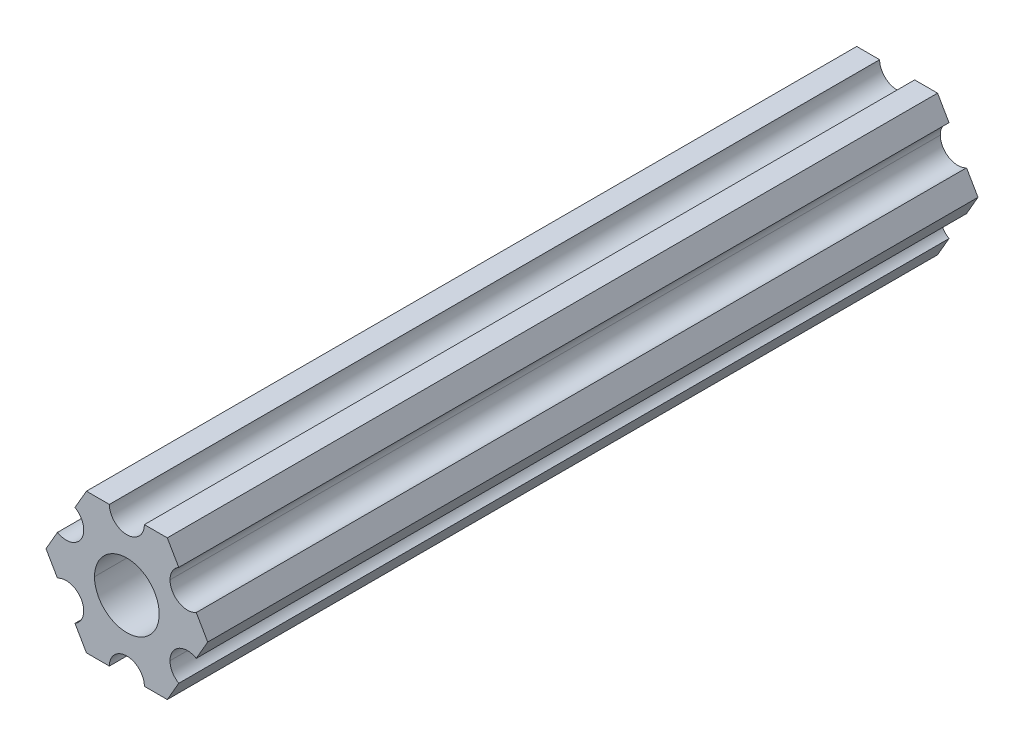
ISO-10303-21;
HEADER;
FILE_DESCRIPTION(('STEP AP214'),'2;1');
FILE_NAME('part.step','',(''),(''),'','','');
FILE_SCHEMA(('AUTOMOTIVE_DESIGN { 1 0 10303 214 1 1 1 1 }'));
ENDSEC;
DATA;
#1=APPLICATION_CONTEXT('core data for automotive mechanical design processes');
#2=APPLICATION_PROTOCOL_DEFINITION('international standard','automotive_design',2000,#1);
#3=PRODUCT_CONTEXT('',#1,'mechanical');
#4=PRODUCT('Part','Part','',(#3));
#5=PRODUCT_RELATED_PRODUCT_CATEGORY('part','',(#4));
#6=PRODUCT_DEFINITION_FORMATION('','',#4);
#7=PRODUCT_DEFINITION_CONTEXT('part definition',#1,'design');
#8=PRODUCT_DEFINITION('design','',#6,#7);
#9=PRODUCT_DEFINITION_SHAPE('','',#8);
#10=(LENGTH_UNIT() NAMED_UNIT(*) SI_UNIT(.MILLI.,.METRE.));
#11=(NAMED_UNIT(*) PLANE_ANGLE_UNIT() SI_UNIT($,.RADIAN.));
#12=(NAMED_UNIT(*) SI_UNIT($,.STERADIAN.) SOLID_ANGLE_UNIT());
#13=UNCERTAINTY_MEASURE_WITH_UNIT(LENGTH_MEASURE(1.E-05),#10,'distance_accuracy_value','');
#14=(GEOMETRIC_REPRESENTATION_CONTEXT(3) GLOBAL_UNCERTAINTY_ASSIGNED_CONTEXT((#13)) GLOBAL_UNIT_ASSIGNED_CONTEXT((#10,
#11,#12)) REPRESENTATION_CONTEXT('',''));
#15=CARTESIAN_POINT('',(0.,0.,0.));
#16=DIRECTION('',(0.,0.,1.));
#17=DIRECTION('',(1.,0.,0.));
#18=AXIS2_PLACEMENT_3D('',#15,#16,#17);
#19=CARTESIAN_POINT('',(0.,0.,69.85));
#20=DIRECTION('',(0.,0.,-1.));
#21=DIRECTION('',(-1.,0.,0.));
#22=AXIS2_PLACEMENT_3D('',#19,#20,#21);
#23=CYLINDRICAL_SURFACE('',#22,2.9337);
#24=DIRECTION('',(0.,0.,-1.));
#25=VECTOR('',#24,1.);
#26=CARTESIAN_POINT('',(2.9337,0.,69.85));
#27=LINE('',#26,#25);
#28=CARTESIAN_POINT('',(2.9337,0.,69.85));
#29=VERTEX_POINT('',#28);
#30=CARTESIAN_POINT('',(2.9337,0.,0.));
#31=VERTEX_POINT('',#30);
#32=EDGE_CURVE('E288',#29,#31,#27,.T.);
#33=ORIENTED_EDGE('',*,*,#32,.F.);
#34=CARTESIAN_POINT('',(0.,0.,69.85));
#35=DIRECTION('',(0.,0.,1.));
#36=DIRECTION('',(1.,0.,0.));
#37=AXIS2_PLACEMENT_3D('',#34,#35,#36);
#38=CIRCLE('',#37,2.9337);
#39=CARTESIAN_POINT('',(-2.9337,0.,69.85));
#40=VERTEX_POINT('',#39);
#41=EDGE_CURVE('E366',#29,#40,#38,.T.);
#42=ORIENTED_EDGE('',*,*,#41,.T.);
#43=DIRECTION('',(0.,0.,-1.));
#44=VECTOR('',#43,1.);
#45=CARTESIAN_POINT('',(-2.9337,0.,69.85));
#46=LINE('',#45,#44);
#47=CARTESIAN_POINT('',(-2.9337,0.,0.));
#48=VERTEX_POINT('',#47);
#49=EDGE_CURVE('E391',#40,#48,#46,.T.);
#50=ORIENTED_EDGE('',*,*,#49,.T.);
#51=CARTESIAN_POINT('',(0.,0.,0.));
#52=DIRECTION('',(0.,0.,1.));
#53=DIRECTION('',(1.,0.,0.));
#54=AXIS2_PLACEMENT_3D('',#51,#52,#53);
#55=CIRCLE('',#54,2.9337);
#56=EDGE_CURVE('E339',#31,#48,#55,.T.);
#57=ORIENTED_EDGE('',*,*,#56,.F.);
#58=EDGE_LOOP('',(#33,#42,#50,#57));
#59=FACE_BOUND('',#58,.T.);
#60=ADVANCED_FACE('F16',(#59),#23,.F.);
#61=CARTESIAN_POINT('',(5.49926150638082,-3.17499966684067,69.85));
#62=DIRECTION('',(0.,0.,-1.));
#63=DIRECTION('',(-1.,0.,0.));
#64=AXIS2_PLACEMENT_3D('',#61,#62,#63);
#65=CYLINDRICAL_SURFACE('',#64,1.5875);
#66=DIRECTION('',(0.,0.,-1.));
#67=VECTOR('',#66,1.);
#68=CARTESIAN_POINT('',(3.91176150638082,-3.17499966684067,69.85));
#69=LINE('',#68,#67);
#70=CARTESIAN_POINT('',(3.91176150638082,-3.17499966684067,69.85));
#71=VERTEX_POINT('',#70);
#72=CARTESIAN_POINT('',(3.91176150638082,-3.17499966684067,0.));
#73=VERTEX_POINT('',#72);
#74=EDGE_CURVE('E235',#71,#73,#69,.T.);
#75=ORIENTED_EDGE('',*,*,#74,.F.);
#76=CARTESIAN_POINT('',(5.49926150638082,-3.17499966684067,69.85));
#77=DIRECTION('',(0.,0.,-1.));
#78=DIRECTION('',(1.,0.,0.));
#79=AXIS2_PLACEMENT_3D('',#76,#77,#78);
#80=CIRCLE('',#79,1.5875);
#81=CARTESIAN_POINT('',(4.70551158967065,-4.54981504343587,69.85));
#82=VERTEX_POINT('',#81);
#83=EDGE_CURVE('E362',#82,#71,#80,.T.);
#84=ORIENTED_EDGE('',*,*,#83,.F.);
#85=DIRECTION('',(0.,0.,-1.));
#86=VECTOR('',#85,1.);
#87=CARTESIAN_POINT('',(4.70551158967065,-4.54981504343587,69.85));
#88=LINE('',#87,#86);
#89=CARTESIAN_POINT('',(4.70551158967065,-4.54981504343587,0.));
#90=VERTEX_POINT('',#89);
#91=EDGE_CURVE('E11',#82,#90,#88,.T.);
#92=ORIENTED_EDGE('',*,*,#91,.T.);
#93=CARTESIAN_POINT('',(5.49926150638082,-3.17499966684067,0.));
#94=DIRECTION('',(0.,0.,-1.));
#95=DIRECTION('',(1.,0.,0.));
#96=AXIS2_PLACEMENT_3D('',#93,#94,#95);
#97=CIRCLE('',#96,1.5875);
#98=EDGE_CURVE('E316',#90,#73,#97,.T.);
#99=ORIENTED_EDGE('',*,*,#98,.T.);
#100=EDGE_LOOP('',(#75,#84,#92,#99));
#101=FACE_BOUND('',#100,.T.);
#102=ADVANCED_FACE('F488',(#101),#65,.F.);
#103=CARTESIAN_POINT('',(3.66617459405346,-6.34999977789375,69.85));
#104=DIRECTION('',(-0.86602543407573,0.499999947533941,0.));
#105=DIRECTION('',(0.,0.,1.));
#106=AXIS2_PLACEMENT_3D('',#103,#104,#105);
#107=PLANE('',#106);
#108=DIRECTION('',(0.499999947533941,0.86602543407573,0.));
#109=VECTOR('',#108,1.);
#110=CARTESIAN_POINT('',(3.66617459405346,-6.34999977789375,0.));
#111=LINE('',#110,#109);
#112=CARTESIAN_POINT('',(3.66617459405346,-6.34999977789375,0.));
#113=VERTEX_POINT('',#112);
#114=EDGE_CURVE('E255',#113,#90,#111,.T.);
#115=ORIENTED_EDGE('',*,*,#114,.T.);
#116=ORIENTED_EDGE('',*,*,#91,.F.);
#117=DIRECTION('',(0.499999947533941,0.86602543407573,0.));
#118=VECTOR('',#117,1.);
#119=CARTESIAN_POINT('',(3.66617459405346,-6.34999977789375,69.85));
#120=LINE('',#119,#118);
#121=CARTESIAN_POINT('',(3.66617459405346,-6.34999977789375,69.85));
#122=VERTEX_POINT('',#121);
#123=EDGE_CURVE('E329',#122,#82,#120,.T.);
#124=ORIENTED_EDGE('',*,*,#123,.F.);
#125=DIRECTION('',(0.,0.,-1.));
#126=VECTOR('',#125,1.);
#127=CARTESIAN_POINT('',(3.66617459405346,-6.34999977789375,69.85));
#128=LINE('',#127,#126);
#129=EDGE_CURVE('E26',#122,#113,#128,.T.);
#130=ORIENTED_EDGE('',*,*,#129,.T.);
#131=EDGE_LOOP('',(#115,#116,#124,#130));
#132=FACE_BOUND('',#131,.T.);
#133=ADVANCED_FACE('F483',(#132),#107,.F.);
#134=CARTESIAN_POINT('',(1.58750038469926,-6.34999990382518,69.85));
#135=DIRECTION('',(-6.05825721258438E-08,1.,0.));
#136=DIRECTION('',(0.,0.,1.));
#137=AXIS2_PLACEMENT_3D('',#134,#135,#136);
#138=PLANE('',#137);
#139=DIRECTION('',(1.,6.05825721258438E-08,0.));
#140=VECTOR('',#139,1.);
#141=CARTESIAN_POINT('',(1.58750038469926,-6.34999990382518,0.));
#142=LINE('',#141,#140);
#143=CARTESIAN_POINT('',(1.58750038469926,-6.34999990382518,0.));
#144=VERTEX_POINT('',#143);
#145=EDGE_CURVE('E250',#144,#113,#142,.T.);
#146=ORIENTED_EDGE('',*,*,#145,.T.);
#147=ORIENTED_EDGE('',*,*,#129,.F.);
#148=DIRECTION('',(1.,6.05825721258438E-08,0.));
#149=VECTOR('',#148,1.);
#150=CARTESIAN_POINT('',(1.58750038469926,-6.34999990382518,69.85));
#151=LINE('',#150,#149);
#152=CARTESIAN_POINT('',(1.58750038469926,-6.34999990382518,69.85));
#153=VERTEX_POINT('',#152);
#154=EDGE_CURVE('E233',#153,#122,#151,.T.);
#155=ORIENTED_EDGE('',*,*,#154,.F.);
#156=DIRECTION('',(0.,0.,-1.));
#157=VECTOR('',#156,1.);
#158=CARTESIAN_POINT('',(1.58750038469926,-6.34999990382518,69.85));
#159=LINE('',#158,#157);
#160=EDGE_CURVE('E304',#153,#144,#159,.T.);
#161=ORIENTED_EDGE('',*,*,#160,.T.);
#162=EDGE_LOOP('',(#146,#147,#155,#161));
#163=FACE_BOUND('',#162,.T.);
#164=ADVANCED_FACE('F493',(#163),#138,.F.);
#165=CARTESIAN_POINT('',(3.8469926204343E-07,-6.35,69.85));
#166=DIRECTION('',(0.,0.,-1.));
#167=DIRECTION('',(-1.,0.,0.));
#168=AXIS2_PLACEMENT_3D('',#165,#166,#167);
#169=CYLINDRICAL_SURFACE('',#168,1.5875);
#170=CARTESIAN_POINT('',(3.8469926204343E-07,-6.35,0.));
#171=DIRECTION('',(0.,0.,-1.));
#172=DIRECTION('',(1.,0.,0.));
#173=AXIS2_PLACEMENT_3D('',#170,#171,#172);
#174=CIRCLE('',#173,1.5875);
#175=CARTESIAN_POINT('',(-1.58749961530073,-6.35000009617482,0.));
#176=VERTEX_POINT('',#175);
#177=EDGE_CURVE('E254',#176,#144,#174,.T.);
#178=ORIENTED_EDGE('',*,*,#177,.T.);
#179=ORIENTED_EDGE('',*,*,#160,.F.);
#180=CARTESIAN_POINT('',(3.8469926204343E-07,-6.35,69.85));
#181=DIRECTION('',(0.,0.,-1.));
#182=DIRECTION('',(1.,0.,0.));
#183=AXIS2_PLACEMENT_3D('',#180,#181,#182);
#184=CIRCLE('',#183,1.5875);
#185=CARTESIAN_POINT('',(-1.58749961530073,-6.35000009617482,69.85));
#186=VERTEX_POINT('',#185);
#187=EDGE_CURVE('E229',#186,#153,#184,.T.);
#188=ORIENTED_EDGE('',*,*,#187,.F.);
#189=DIRECTION('',(0.,0.,-1.));
#190=VECTOR('',#189,1.);
#191=CARTESIAN_POINT('',(-1.58749961530073,-6.35000009617482,69.85));
#192=LINE('',#191,#190);
#193=EDGE_CURVE('E330',#186,#176,#192,.T.);
#194=ORIENTED_EDGE('',*,*,#193,.T.);
#195=EDGE_LOOP('',(#178,#179,#188,#194));
#196=FACE_BOUND('',#195,.T.);
#197=ADVANCED_FACE('F498',(#196),#169,.F.);
#198=CARTESIAN_POINT('',(-3.66617382465481,-6.35000022210628,69.85));
#199=DIRECTION('',(-6.05825854783851E-08,1.,0.));
#200=DIRECTION('',(0.,0.,1.));
#201=AXIS2_PLACEMENT_3D('',#198,#199,#200);
#202=PLANE('',#201);
#203=DIRECTION('',(1.,6.05825854783851E-08,0.));
#204=VECTOR('',#203,1.);
#205=CARTESIAN_POINT('',(-3.66617382465481,-6.35000022210628,0.));
#206=LINE('',#205,#204);
#207=CARTESIAN_POINT('',(-3.66617382465481,-6.35000022210628,0.));
#208=VERTEX_POINT('',#207);
#209=EDGE_CURVE('E223',#208,#176,#206,.T.);
#210=ORIENTED_EDGE('',*,*,#209,.T.);
#211=ORIENTED_EDGE('',*,*,#193,.F.);
#212=DIRECTION('',(1.,6.05825854783851E-08,0.));
#213=VECTOR('',#212,1.);
#214=CARTESIAN_POINT('',(-3.66617382465481,-6.35000022210628,69.85));
#215=LINE('',#214,#213);
#216=CARTESIAN_POINT('',(-3.66617382465481,-6.35000022210628,69.85));
#217=VERTEX_POINT('',#216);
#218=EDGE_CURVE('E234',#217,#186,#215,.T.);
#219=ORIENTED_EDGE('',*,*,#218,.F.);
#220=DIRECTION('',(0.,0.,-1.));
#221=VECTOR('',#220,1.);
#222=CARTESIAN_POINT('',(-3.66617382465481,-6.35000022210628,69.85));
#223=LINE('',#222,#221);
#224=EDGE_CURVE('E297',#217,#208,#223,.T.);
#225=ORIENTED_EDGE('',*,*,#224,.T.);
#226=EDGE_LOOP('',(#210,#211,#219,#225));
#227=FACE_BOUND('',#226,.T.);
#228=ADVANCED_FACE('F676',(#227),#202,.F.);
#229=CARTESIAN_POINT('',(-4.70551103839172,-4.54981561357972,69.85));
#230=DIRECTION('',(0.866025373493152,0.500000052466045,0.));
#231=DIRECTION('',(0.,0.,-1.));
#232=AXIS2_PLACEMENT_3D('',#229,#230,#231);
#233=PLANE('',#232);
#234=DIRECTION('',(0.500000052466045,-0.866025373493152,0.));
#235=VECTOR('',#234,1.);
#236=CARTESIAN_POINT('',(-4.70551103839172,-4.54981561357972,0.));
#237=LINE('',#236,#235);
#238=CARTESIAN_POINT('',(-4.70551103839172,-4.54981561357972,0.));
#239=VERTEX_POINT('',#238);
#240=EDGE_CURVE('E216',#239,#208,#237,.T.);
#241=ORIENTED_EDGE('',*,*,#240,.T.);
#242=ORIENTED_EDGE('',*,*,#224,.F.);
#243=DIRECTION('',(0.500000052466045,-0.866025373493152,0.));
#244=VECTOR('',#243,1.);
#245=CARTESIAN_POINT('',(-4.70551103839172,-4.54981561357972,69.85));
#246=LINE('',#245,#244);
#247=CARTESIAN_POINT('',(-4.70551103839172,-4.54981561357972,69.85));
#248=VERTEX_POINT('',#247);
#249=EDGE_CURVE('E320',#248,#217,#246,.T.);
#250=ORIENTED_EDGE('',*,*,#249,.F.);
#251=DIRECTION('',(0.,0.,-1.));
#252=VECTOR('',#251,1.);
#253=CARTESIAN_POINT('',(-4.70551103839172,-4.54981561357972,69.85));
#254=LINE('',#253,#252);
#255=EDGE_CURVE('E203',#248,#239,#254,.T.);
#256=ORIENTED_EDGE('',*,*,#255,.T.);
#257=EDGE_LOOP('',(#241,#242,#250,#256));
#258=FACE_BOUND('',#257,.T.);
#259=ADVANCED_FACE('F18',(#258),#233,.F.);
#260=CARTESIAN_POINT('',(-5.49926112168156,-3.17500033315934,69.85));
#261=DIRECTION('',(0.,0.,-1.));
#262=DIRECTION('',(-1.,0.,0.));
#263=AXIS2_PLACEMENT_3D('',#260,#261,#262);
#264=CYLINDRICAL_SURFACE('',#263,1.5875);
#265=CARTESIAN_POINT('',(-5.49926112168156,-3.17500033315934,0.));
#266=DIRECTION('',(0.,0.,-1.));
#267=DIRECTION('',(1.,0.,0.));
#268=AXIS2_PLACEMENT_3D('',#265,#266,#267);
#269=CIRCLE('',#268,1.5875);
#270=CARTESIAN_POINT('',(-6.29301120497141,-1.80018505273897,0.));
#271=VERTEX_POINT('',#270);
#272=EDGE_CURVE('E195',#271,#239,#269,.T.);
#273=ORIENTED_EDGE('',*,*,#272,.T.);
#274=ORIENTED_EDGE('',*,*,#255,.F.);
#275=CARTESIAN_POINT('',(-5.49926112168156,-3.17500033315934,69.85));
#276=DIRECTION('',(0.,0.,-1.));
#277=DIRECTION('',(1.,0.,0.));
#278=AXIS2_PLACEMENT_3D('',#275,#276,#277);
#279=CIRCLE('',#278,1.5875);
#280=CARTESIAN_POINT('',(-6.29301120497141,-1.80018505273897,69.85));
#281=VERTEX_POINT('',#280);
#282=EDGE_CURVE('E198',#281,#248,#279,.T.);
#283=ORIENTED_EDGE('',*,*,#282,.F.);
#284=DIRECTION('',(0.,0.,-1.));
#285=VECTOR('',#284,1.);
#286=CARTESIAN_POINT('',(-6.29301120497141,-1.80018505273897,69.85));
#287=LINE('',#286,#285);
#288=EDGE_CURVE('E20',#281,#271,#287,.T.);
#289=ORIENTED_EDGE('',*,*,#288,.T.);
#290=EDGE_LOOP('',(#273,#274,#283,#289));
#291=FACE_BOUND('',#290,.T.);
#292=ADVANCED_FACE('F192',(#291),#264,.F.);
#293=CARTESIAN_POINT('',(-7.33234841870827,-4.44212523790841E-07,69.85));
#294=DIRECTION('',(0.866025373493151,0.500000052466045,0.));
#295=DIRECTION('',(0.,0.,-1.));
#296=AXIS2_PLACEMENT_3D('',#293,#294,#295);
#297=PLANE('',#296);
#298=DIRECTION('',(0.500000052466045,-0.866025373493151,0.));
#299=VECTOR('',#298,1.);
#300=CARTESIAN_POINT('',(-7.33234841870827,-4.44212523790841E-07,0.));
#301=LINE('',#300,#299);
#302=CARTESIAN_POINT('',(-7.33234841870827,-4.44212523790841E-07,0.));
#303=VERTEX_POINT('',#302);
#304=EDGE_CURVE('E206',#303,#271,#301,.T.);
#305=ORIENTED_EDGE('',*,*,#304,.T.);
#306=ORIENTED_EDGE('',*,*,#288,.F.);
#307=DIRECTION('',(0.500000052466045,-0.866025373493151,0.));
#308=VECTOR('',#307,1.);
#309=CARTESIAN_POINT('',(-7.33234841870827,-4.44212523790841E-07,69.85));
#310=LINE('',#309,#308);
#311=CARTESIAN_POINT('',(-7.33234841870827,-4.44212523790841E-07,69.85));
#312=VERTEX_POINT('',#311);
#313=EDGE_CURVE('E272',#312,#281,#310,.T.);
#314=ORIENTED_EDGE('',*,*,#313,.F.);
#315=DIRECTION('',(0.,0.,-1.));
#316=VECTOR('',#315,1.);
#317=CARTESIAN_POINT('',(-7.33234841870827,-4.44212523790841E-07,69.85));
#318=LINE('',#317,#316);
#319=EDGE_CURVE('E204',#312,#303,#318,.T.);
#320=ORIENTED_EDGE('',*,*,#319,.T.);
#321=EDGE_LOOP('',(#305,#306,#314,#320));
#322=FACE_BOUND('',#321,.T.);
#323=ADVANCED_FACE('F207',(#322),#297,.F.);
#324=CARTESIAN_POINT('',(-6.29301142309098,1.80018429024547,69.85));
#325=DIRECTION('',(0.866025434075724,-0.499999947533952,0.));
#326=DIRECTION('',(0.,0.,-1.));
#327=AXIS2_PLACEMENT_3D('',#324,#325,#326);
#328=PLANE('',#327);
#329=DIRECTION('',(-0.499999947533951,-0.866025434075724,0.));
#330=VECTOR('',#329,1.);
#331=CARTESIAN_POINT('',(-6.29301142309098,1.80018429024547,0.));
#332=LINE('',#331,#330);
#333=CARTESIAN_POINT('',(-6.29301142309098,1.80018429024547,0.));
#334=VERTEX_POINT('',#333);
#335=EDGE_CURVE('E211',#334,#303,#332,.T.);
#336=ORIENTED_EDGE('',*,*,#335,.T.);
#337=ORIENTED_EDGE('',*,*,#319,.F.);
#338=DIRECTION('',(-0.499999947533951,-0.866025434075724,0.));
#339=VECTOR('',#338,1.);
#340=CARTESIAN_POINT('',(-6.29301142309098,1.80018429024547,69.85));
#341=LINE('',#340,#339);
#342=CARTESIAN_POINT('',(-6.29301142309098,1.80018429024547,69.85));
#343=VERTEX_POINT('',#342);
#344=EDGE_CURVE('E268',#343,#312,#341,.T.);
#345=ORIENTED_EDGE('',*,*,#344,.F.);
#346=DIRECTION('',(0.,0.,-1.));
#347=VECTOR('',#346,1.);
#348=CARTESIAN_POINT('',(-6.29301142309098,1.80018429024547,69.85));
#349=LINE('',#348,#347);
#350=EDGE_CURVE('E152',#343,#334,#349,.T.);
#351=ORIENTED_EDGE('',*,*,#350,.T.);
#352=EDGE_LOOP('',(#336,#337,#345,#351));
#353=FACE_BOUND('',#352,.T.);
#354=ADVANCED_FACE('F757',(#353),#328,.F.);
#355=CARTESIAN_POINT('',(-5.49926150638082,3.17499966684067,69.85));
#356=DIRECTION('',(0.,0.,-1.));
#357=DIRECTION('',(-1.,0.,0.));
#358=AXIS2_PLACEMENT_3D('',#355,#356,#357);
#359=CYLINDRICAL_SURFACE('',#358,1.5875);
#360=CARTESIAN_POINT('',(-5.49926150638082,3.17499966684067,0.));
#361=DIRECTION('',(0.,0.,-1.));
#362=DIRECTION('',(1.,0.,0.));
#363=AXIS2_PLACEMENT_3D('',#360,#361,#362);
#364=CIRCLE('',#363,1.5875);
#365=CARTESIAN_POINT('',(-4.70551158967065,4.54981504343587,0.));
#366=VERTEX_POINT('',#365);
#367=EDGE_CURVE('E249',#366,#334,#364,.T.);
#368=ORIENTED_EDGE('',*,*,#367,.T.);
#369=ORIENTED_EDGE('',*,*,#350,.F.);
#370=CARTESIAN_POINT('',(-5.49926150638082,3.17499966684067,69.85));
#371=DIRECTION('',(0.,0.,-1.));
#372=DIRECTION('',(1.,0.,0.));
#373=AXIS2_PLACEMENT_3D('',#370,#371,#372);
#374=CIRCLE('',#373,1.5875);
#375=CARTESIAN_POINT('',(-4.70551158967065,4.54981504343587,69.85));
#376=VERTEX_POINT('',#375);
#377=EDGE_CURVE('E273',#376,#343,#374,.T.);
#378=ORIENTED_EDGE('',*,*,#377,.F.);
#379=DIRECTION('',(0.,0.,-1.));
#380=VECTOR('',#379,1.);
#381=CARTESIAN_POINT('',(-4.70551158967065,4.54981504343587,69.85));
#382=LINE('',#381,#380);
#383=EDGE_CURVE('E136',#376,#366,#382,.T.);
#384=ORIENTED_EDGE('',*,*,#383,.T.);
#385=EDGE_LOOP('',(#368,#369,#378,#384));
#386=FACE_BOUND('',#385,.T.);
#387=ADVANCED_FACE('F768',(#386),#359,.F.);
#388=CARTESIAN_POINT('',(-3.66617459405349,6.3499997778937,69.85));
#389=DIRECTION('',(0.866025434075729,-0.499999947533942,0.));
#390=DIRECTION('',(0.,0.,-1.));
#391=AXIS2_PLACEMENT_3D('',#388,#389,#390);
#392=PLANE('',#391);
#393=DIRECTION('',(-0.499999947533943,-0.866025434075729,0.));
#394=VECTOR('',#393,1.);
#395=CARTESIAN_POINT('',(-3.66617459405349,6.3499997778937,0.));
#396=LINE('',#395,#394);
#397=CARTESIAN_POINT('',(-3.66617459405349,6.3499997778937,0.));
#398=VERTEX_POINT('',#397);
#399=EDGE_CURVE('E261',#398,#366,#396,.T.);
#400=ORIENTED_EDGE('',*,*,#399,.T.);
#401=ORIENTED_EDGE('',*,*,#383,.F.);
#402=DIRECTION('',(-0.499999947533943,-0.866025434075729,0.));
#403=VECTOR('',#402,1.);
#404=CARTESIAN_POINT('',(-3.66617459405349,6.3499997778937,69.85));
#405=LINE('',#404,#403);
#406=CARTESIAN_POINT('',(-3.66617459405349,6.3499997778937,69.85));
#407=VERTEX_POINT('',#406);
#408=EDGE_CURVE('E376',#407,#376,#405,.T.);
#409=ORIENTED_EDGE('',*,*,#408,.F.);
#410=DIRECTION('',(0.,0.,-1.));
#411=VECTOR('',#410,1.);
#412=CARTESIAN_POINT('',(-3.66617459405349,6.3499997778937,69.85));
#413=LINE('',#412,#411);
#414=EDGE_CURVE('E280',#407,#398,#413,.T.);
#415=ORIENTED_EDGE('',*,*,#414,.T.);
#416=EDGE_LOOP('',(#400,#401,#409,#415));
#417=FACE_BOUND('',#416,.T.);
#418=ADVANCED_FACE('F443',(#417),#392,.F.);
#419=CARTESIAN_POINT('',(-1.58750038469926,6.34999990382518,69.85));
#420=DIRECTION('',(6.05825963273174E-08,-1.,0.));
#421=DIRECTION('',(0.,0.,-1.));
#422=AXIS2_PLACEMENT_3D('',#419,#420,#421);
#423=PLANE('',#422);
#424=DIRECTION('',(-1.,-6.05825963273174E-08,0.));
#425=VECTOR('',#424,1.);
#426=CARTESIAN_POINT('',(-1.58750038469926,6.34999990382518,0.));
#427=LINE('',#426,#425);
#428=CARTESIAN_POINT('',(-1.58750038469926,6.34999990382519,0.));
#429=VERTEX_POINT('',#428);
#430=EDGE_CURVE('E256',#429,#398,#427,.T.);
#431=ORIENTED_EDGE('',*,*,#430,.T.);
#432=ORIENTED_EDGE('',*,*,#414,.F.);
#433=DIRECTION('',(-1.,-6.05825963273174E-08,0.));
#434=VECTOR('',#433,1.);
#435=CARTESIAN_POINT('',(-1.58750038469926,6.34999990382518,69.85));
#436=LINE('',#435,#434);
#437=CARTESIAN_POINT('',(-1.58750038469926,6.34999990382519,69.85));
#438=VERTEX_POINT('',#437);
#439=EDGE_CURVE('E425',#438,#407,#436,.T.);
#440=ORIENTED_EDGE('',*,*,#439,.F.);
#441=DIRECTION('',(0.,0.,-1.));
#442=VECTOR('',#441,1.);
#443=CARTESIAN_POINT('',(-1.58750038469926,6.34999990382519,69.85));
#444=LINE('',#443,#442);
#445=EDGE_CURVE('E283',#438,#429,#444,.T.);
#446=ORIENTED_EDGE('',*,*,#445,.T.);
#447=EDGE_LOOP('',(#431,#432,#440,#446));
#448=FACE_BOUND('',#447,.T.);
#449=ADVANCED_FACE('F767',(#448),#423,.F.);
#450=CARTESIAN_POINT('',(-3.84699260060323E-07,6.35,69.85));
#451=DIRECTION('',(0.,0.,-1.));
#452=DIRECTION('',(-1.,0.,0.));
#453=AXIS2_PLACEMENT_3D('',#450,#451,#452);
#454=CYLINDRICAL_SURFACE('',#453,1.5875);
#455=CARTESIAN_POINT('',(-3.84699260060323E-07,6.35,0.));
#456=DIRECTION('',(0.,0.,-1.));
#457=DIRECTION('',(1.,0.,0.));
#458=AXIS2_PLACEMENT_3D('',#455,#456,#457);
#459=CIRCLE('',#458,1.5875);
#460=CARTESIAN_POINT('',(1.58749961530074,6.35000009617482,0.));
#461=VERTEX_POINT('',#460);
#462=EDGE_CURVE('E260',#461,#429,#459,.T.);
#463=ORIENTED_EDGE('',*,*,#462,.T.);
#464=ORIENTED_EDGE('',*,*,#445,.F.);
#465=CARTESIAN_POINT('',(-3.84699260060323E-07,6.35,69.85));
#466=DIRECTION('',(0.,0.,-1.));
#467=DIRECTION('',(1.,0.,0.));
#468=AXIS2_PLACEMENT_3D('',#465,#466,#467);
#469=CIRCLE('',#468,1.5875);
#470=CARTESIAN_POINT('',(1.58749961530074,6.35000009617482,69.85));
#471=VERTEX_POINT('',#470);
#472=EDGE_CURVE('E360',#471,#438,#469,.T.);
#473=ORIENTED_EDGE('',*,*,#472,.F.);
#474=DIRECTION('',(0.,0.,-1.));
#475=VECTOR('',#474,1.);
#476=CARTESIAN_POINT('',(1.58749961530074,6.35000009617482,69.85));
#477=LINE('',#476,#475);
#478=EDGE_CURVE('E367',#471,#461,#477,.T.);
#479=ORIENTED_EDGE('',*,*,#478,.T.);
#480=EDGE_LOOP('',(#463,#464,#473,#479));
#481=FACE_BOUND('',#480,.T.);
#482=ADVANCED_FACE('F727',(#481),#454,.F.);
#483=CARTESIAN_POINT('',(3.66617382465481,6.35000022210627,69.85));
#484=DIRECTION('',(6.05825850611185E-08,-1.,0.));
#485=DIRECTION('',(0.,0.,-1.));
#486=AXIS2_PLACEMENT_3D('',#483,#484,#485);
#487=PLANE('',#486);
#488=DIRECTION('',(-1.,-6.05825850611185E-08,0.));
#489=VECTOR('',#488,1.);
#490=CARTESIAN_POINT('',(3.66617382465481,6.35000022210627,0.));
#491=LINE('',#490,#489);
#492=CARTESIAN_POINT('',(3.66617382465481,6.35000022210627,0.));
#493=VERTEX_POINT('',#492);
#494=EDGE_CURVE('E274',#493,#461,#491,.T.);
#495=ORIENTED_EDGE('',*,*,#494,.T.);
#496=ORIENTED_EDGE('',*,*,#478,.F.);
#497=DIRECTION('',(-1.,-6.05825850611185E-08,0.));
#498=VECTOR('',#497,1.);
#499=CARTESIAN_POINT('',(3.66617382465481,6.35000022210627,69.85));
#500=LINE('',#499,#498);
#501=CARTESIAN_POINT('',(3.66617382465481,6.35000022210627,69.85));
#502=VERTEX_POINT('',#501);
#503=EDGE_CURVE('E400',#502,#471,#500,.T.);
#504=ORIENTED_EDGE('',*,*,#503,.F.);
#505=DIRECTION('',(0.,0.,-1.));
#506=VECTOR('',#505,1.);
#507=CARTESIAN_POINT('',(3.66617382465481,6.35000022210627,69.85));
#508=LINE('',#507,#506);
#509=EDGE_CURVE('E54',#502,#493,#508,.T.);
#510=ORIENTED_EDGE('',*,*,#509,.T.);
#511=EDGE_LOOP('',(#495,#496,#504,#510));
#512=FACE_BOUND('',#511,.T.);
#513=ADVANCED_FACE('F722',(#512),#487,.F.);
#514=CARTESIAN_POINT('',(4.70551103839172,4.54981561357972,69.85));
#515=DIRECTION('',(-0.866025373493151,-0.500000052466046,0.));
#516=DIRECTION('',(-0.500000052466046,0.866025373493151,0.));
#517=AXIS2_PLACEMENT_3D('',#514,#515,#516);
#518=PLANE('',#517);
#519=DIRECTION('',(-0.500000052466046,0.866025373493151,0.));
#520=VECTOR('',#519,1.);
#521=CARTESIAN_POINT('',(4.70551103839172,4.54981561357972,0.));
#522=LINE('',#521,#520);
#523=CARTESIAN_POINT('',(4.70551103839172,4.54981561357972,0.));
#524=VERTEX_POINT('',#523);
#525=EDGE_CURVE('E277',#524,#493,#522,.T.);
#526=ORIENTED_EDGE('',*,*,#525,.T.);
#527=ORIENTED_EDGE('',*,*,#509,.F.);
#528=DIRECTION('',(-0.500000052466046,0.866025373493151,0.));
#529=VECTOR('',#528,1.);
#530=CARTESIAN_POINT('',(4.70551103839172,4.54981561357972,69.85));
#531=LINE('',#530,#529);
#532=CARTESIAN_POINT('',(4.70551103839172,4.54981561357972,69.85));
#533=VERTEX_POINT('',#532);
#534=EDGE_CURVE('E227',#533,#502,#531,.T.);
#535=ORIENTED_EDGE('',*,*,#534,.F.);
#536=DIRECTION('',(0.,0.,-1.));
#537=VECTOR('',#536,1.);
#538=CARTESIAN_POINT('',(4.70551103839172,4.54981561357972,69.85));
#539=LINE('',#538,#537);
#540=EDGE_CURVE('E246',#533,#524,#539,.T.);
#541=ORIENTED_EDGE('',*,*,#540,.T.);
#542=EDGE_LOOP('',(#526,#527,#535,#541));
#543=FACE_BOUND('',#542,.T.);
#544=ADVANCED_FACE('F726',(#543),#518,.F.);
#545=CARTESIAN_POINT('',(5.49926112168156,3.17500033315934,69.85));
#546=DIRECTION('',(0.,0.,-1.));
#547=DIRECTION('',(-1.,0.,0.));
#548=AXIS2_PLACEMENT_3D('',#545,#546,#547);
#549=CYLINDRICAL_SURFACE('',#548,1.5875);
#550=DIRECTION('',(0.,0.,-1.));
#551=VECTOR('',#550,1.);
#552=CARTESIAN_POINT('',(3.91176112168156,3.17500033315934,69.85));
#553=LINE('',#552,#551);
#554=CARTESIAN_POINT('',(3.91176112168156,3.17500033315934,69.85));
#555=VERTEX_POINT('',#554);
#556=CARTESIAN_POINT('',(3.91176112168156,3.17500033315934,0.));
#557=VERTEX_POINT('',#556);
#558=EDGE_CURVE('E289',#555,#557,#553,.T.);
#559=ORIENTED_EDGE('',*,*,#558,.F.);
#560=CARTESIAN_POINT('',(5.49926112168156,3.17500033315934,69.85));
#561=DIRECTION('',(0.,0.,-1.));
#562=DIRECTION('',(1.,0.,0.));
#563=AXIS2_PLACEMENT_3D('',#560,#561,#562);
#564=CIRCLE('',#563,1.5875);
#565=CARTESIAN_POINT('',(6.29301120497139,1.80018505273894,69.85));
#566=VERTEX_POINT('',#565);
#567=EDGE_CURVE('E267',#566,#555,#564,.T.);
#568=ORIENTED_EDGE('',*,*,#567,.F.);
#569=DIRECTION('',(0.,0.,-1.));
#570=VECTOR('',#569,1.);
#571=CARTESIAN_POINT('',(6.29301120497139,1.80018505273894,69.85));
#572=LINE('',#571,#570);
#573=CARTESIAN_POINT('',(6.29301120497139,1.80018505273894,0.));
#574=VERTEX_POINT('',#573);
#575=EDGE_CURVE('E40',#566,#574,#572,.T.);
#576=ORIENTED_EDGE('',*,*,#575,.T.);
#577=CARTESIAN_POINT('',(5.49926112168156,3.17500033315934,0.));
#578=DIRECTION('',(0.,0.,-1.));
#579=DIRECTION('',(1.,0.,0.));
#580=AXIS2_PLACEMENT_3D('',#577,#578,#579);
#581=CIRCLE('',#580,1.5875);
#582=EDGE_CURVE('E340',#574,#557,#581,.T.);
#583=ORIENTED_EDGE('',*,*,#582,.T.);
#584=EDGE_LOOP('',(#559,#568,#576,#583));
#585=FACE_BOUND('',#584,.T.);
#586=ADVANCED_FACE('F688',(#585),#549,.F.);
#587=CARTESIAN_POINT('',(7.33234841870827,4.44212519169686E-07,69.85));
#588=DIRECTION('',(-0.866025373493145,-0.500000052466057,0.));
#589=DIRECTION('',(-0.500000052466057,0.866025373493145,0.));
#590=AXIS2_PLACEMENT_3D('',#587,#588,#589);
#591=PLANE('',#590);
#592=DIRECTION('',(-0.500000052466056,0.866025373493145,0.));
#593=VECTOR('',#592,1.);
#594=CARTESIAN_POINT('',(7.33234841870827,4.44212519169686E-07,0.));
#595=LINE('',#594,#593);
#596=CARTESIAN_POINT('',(7.33234841870827,4.44212519169686E-07,0.));
#597=VERTEX_POINT('',#596);
#598=EDGE_CURVE('E337',#597,#574,#595,.T.);
#599=ORIENTED_EDGE('',*,*,#598,.T.);
#600=ORIENTED_EDGE('',*,*,#575,.F.);
#601=DIRECTION('',(-0.500000052466056,0.866025373493145,0.));
#602=VECTOR('',#601,1.);
#603=CARTESIAN_POINT('',(7.33234841870827,4.44212519169686E-07,69.85));
#604=LINE('',#603,#602);
#605=CARTESIAN_POINT('',(7.33234841870827,4.44212519169686E-07,69.85));
#606=VERTEX_POINT('',#605);
#607=EDGE_CURVE('E245',#606,#566,#604,.T.);
#608=ORIENTED_EDGE('',*,*,#607,.F.);
#609=DIRECTION('',(0.,0.,-1.));
#610=VECTOR('',#609,1.);
#611=CARTESIAN_POINT('',(7.33234841870827,4.44212519169686E-07,69.85));
#612=LINE('',#611,#610);
#613=EDGE_CURVE('E348',#606,#597,#612,.T.);
#614=ORIENTED_EDGE('',*,*,#613,.T.);
#615=EDGE_LOOP('',(#599,#600,#608,#614));
#616=FACE_BOUND('',#615,.T.);
#617=ADVANCED_FACE('F683',(#616),#591,.F.);
#618=CARTESIAN_POINT('',(6.29301142309098,-1.80018429024546,69.85));
#619=DIRECTION('',(-0.866025434075723,0.499999947533953,0.));
#620=DIRECTION('',(0.,0.,1.));
#621=AXIS2_PLACEMENT_3D('',#618,#619,#620);
#622=PLANE('',#621);
#623=DIRECTION('',(0.499999947533953,0.866025434075723,0.));
#624=VECTOR('',#623,1.);
#625=CARTESIAN_POINT('',(6.29301142309098,-1.80018429024546,0.));
#626=LINE('',#625,#624);
#627=CARTESIAN_POINT('',(6.29301142309098,-1.80018429024546,0.));
#628=VERTEX_POINT('',#627);
#629=EDGE_CURVE('E379',#628,#597,#626,.T.);
#630=ORIENTED_EDGE('',*,*,#629,.T.);
#631=ORIENTED_EDGE('',*,*,#613,.F.);
#632=DIRECTION('',(0.499999947533953,0.866025434075723,0.));
#633=VECTOR('',#632,1.);
#634=CARTESIAN_POINT('',(6.29301142309098,-1.80018429024546,69.85));
#635=LINE('',#634,#633);
#636=CARTESIAN_POINT('',(6.29301142309098,-1.80018429024546,69.85));
#637=VERTEX_POINT('',#636);
#638=EDGE_CURVE('E241',#637,#606,#635,.T.);
#639=ORIENTED_EDGE('',*,*,#638,.F.);
#640=DIRECTION('',(0.,0.,-1.));
#641=VECTOR('',#640,1.);
#642=CARTESIAN_POINT('',(6.29301142309098,-1.80018429024546,69.85));
#643=LINE('',#642,#641);
#644=EDGE_CURVE('E301',#637,#628,#643,.T.);
#645=ORIENTED_EDGE('',*,*,#644,.T.);
#646=EDGE_LOOP('',(#630,#631,#639,#645));
#647=FACE_BOUND('',#646,.T.);
#648=ADVANCED_FACE('F687',(#647),#622,.F.);
#649=CARTESIAN_POINT('',(5.49926112168156,3.17500033315934,0.));
#650=DIRECTION('',(0.,0.,1.));
#651=DIRECTION('',(1.,0.,0.));
#652=AXIS2_PLACEMENT_3D('',#649,#650,#651);
#653=PLANE('',#652);
#654=CARTESIAN_POINT('',(0.,0.,0.));
#655=DIRECTION('',(0.,0.,1.));
#656=DIRECTION('',(1.,0.,0.));
#657=AXIS2_PLACEMENT_3D('',#654,#655,#656);
#658=CIRCLE('',#657,2.9337);
#659=EDGE_CURVE('E312',#48,#31,#658,.T.);
#660=ORIENTED_EDGE('',*,*,#659,.T.);
#661=ORIENTED_EDGE('',*,*,#56,.T.);
#662=EDGE_LOOP('',(#660,#661));
#663=FACE_BOUND('',#662,.T.);
#664=ORIENTED_EDGE('',*,*,#629,.F.);
#665=CARTESIAN_POINT('',(5.49926150638082,-3.17499966684067,0.));
#666=DIRECTION('',(0.,0.,-1.));
#667=DIRECTION('',(1.,0.,0.));
#668=AXIS2_PLACEMENT_3D('',#665,#666,#667);
#669=CIRCLE('',#668,1.5875);
#670=EDGE_CURVE('E239',#73,#628,#669,.T.);
#671=ORIENTED_EDGE('',*,*,#670,.F.);
#672=ORIENTED_EDGE('',*,*,#98,.F.);
#673=ORIENTED_EDGE('',*,*,#114,.F.);
#674=ORIENTED_EDGE('',*,*,#145,.F.);
#675=ORIENTED_EDGE('',*,*,#177,.F.);
#676=ORIENTED_EDGE('',*,*,#209,.F.);
#677=ORIENTED_EDGE('',*,*,#240,.F.);
#678=ORIENTED_EDGE('',*,*,#272,.F.);
#679=ORIENTED_EDGE('',*,*,#304,.F.);
#680=ORIENTED_EDGE('',*,*,#335,.F.);
#681=ORIENTED_EDGE('',*,*,#367,.F.);
#682=ORIENTED_EDGE('',*,*,#399,.F.);
#683=ORIENTED_EDGE('',*,*,#430,.F.);
#684=ORIENTED_EDGE('',*,*,#462,.F.);
#685=ORIENTED_EDGE('',*,*,#494,.F.);
#686=ORIENTED_EDGE('',*,*,#525,.F.);
#687=CARTESIAN_POINT('',(5.49926112168156,3.17500033315934,0.));
#688=DIRECTION('',(0.,0.,-1.));
#689=DIRECTION('',(1.,0.,0.));
#690=AXIS2_PLACEMENT_3D('',#687,#688,#689);
#691=CIRCLE('',#690,1.5875);
#692=EDGE_CURVE('E293',#557,#524,#691,.T.);
#693=ORIENTED_EDGE('',*,*,#692,.F.);
#694=ORIENTED_EDGE('',*,*,#582,.F.);
#695=ORIENTED_EDGE('',*,*,#598,.F.);
#696=EDGE_LOOP('',(#664,#671,#672,#673,#674,#675,#676,#677,#678,#679,#680,#681,#682,#683,#684,
#685,#686,#693,#694,#695));
#697=FACE_BOUND('',#696,.T.);
#698=ADVANCED_FACE('F213',(#663,#697),#653,.F.);
#699=CARTESIAN_POINT('',(5.49926112168156,3.17500033315934,69.85));
#700=DIRECTION('',(0.,0.,1.));
#701=DIRECTION('',(1.,0.,0.));
#702=AXIS2_PLACEMENT_3D('',#699,#700,#701);
#703=PLANE('',#702);
#704=CARTESIAN_POINT('',(0.,0.,69.85));
#705=DIRECTION('',(0.,0.,1.));
#706=DIRECTION('',(1.,0.,0.));
#707=AXIS2_PLACEMENT_3D('',#704,#705,#706);
#708=CIRCLE('',#707,2.9337);
#709=EDGE_CURVE('E284',#40,#29,#708,.T.);
#710=ORIENTED_EDGE('',*,*,#709,.F.);
#711=ORIENTED_EDGE('',*,*,#41,.F.);
#712=EDGE_LOOP('',(#710,#711));
#713=FACE_BOUND('',#712,.T.);
#714=ORIENTED_EDGE('',*,*,#638,.T.);
#715=ORIENTED_EDGE('',*,*,#607,.T.);
#716=ORIENTED_EDGE('',*,*,#567,.T.);
#717=CARTESIAN_POINT('',(5.49926112168156,3.17500033315934,69.85));
#718=DIRECTION('',(0.,0.,-1.));
#719=DIRECTION('',(1.,0.,0.));
#720=AXIS2_PLACEMENT_3D('',#717,#718,#719);
#721=CIRCLE('',#720,1.5875);
#722=EDGE_CURVE('E294',#555,#533,#721,.T.);
#723=ORIENTED_EDGE('',*,*,#722,.T.);
#724=ORIENTED_EDGE('',*,*,#534,.T.);
#725=ORIENTED_EDGE('',*,*,#503,.T.);
#726=ORIENTED_EDGE('',*,*,#472,.T.);
#727=ORIENTED_EDGE('',*,*,#439,.T.);
#728=ORIENTED_EDGE('',*,*,#408,.T.);
#729=ORIENTED_EDGE('',*,*,#377,.T.);
#730=ORIENTED_EDGE('',*,*,#344,.T.);
#731=ORIENTED_EDGE('',*,*,#313,.T.);
#732=ORIENTED_EDGE('',*,*,#282,.T.);
#733=ORIENTED_EDGE('',*,*,#249,.T.);
#734=ORIENTED_EDGE('',*,*,#218,.T.);
#735=ORIENTED_EDGE('',*,*,#187,.T.);
#736=ORIENTED_EDGE('',*,*,#154,.T.);
#737=ORIENTED_EDGE('',*,*,#123,.T.);
#738=ORIENTED_EDGE('',*,*,#83,.T.);
#739=CARTESIAN_POINT('',(5.49926150638082,-3.17499966684067,69.85));
#740=DIRECTION('',(0.,0.,-1.));
#741=DIRECTION('',(1.,0.,0.));
#742=AXIS2_PLACEMENT_3D('',#739,#740,#741);
#743=CIRCLE('',#742,1.5875);
#744=EDGE_CURVE('E240',#71,#637,#743,.T.);
#745=ORIENTED_EDGE('',*,*,#744,.T.);
#746=EDGE_LOOP('',(#714,#715,#716,#723,#724,#725,#726,#727,#728,#729,#730,#731,#732,#733,#734,
#735,#736,#737,#738,#745));
#747=FACE_BOUND('',#746,.T.);
#748=ADVANCED_FACE('F439',(#713,#747),#703,.T.);
#749=CARTESIAN_POINT('',(5.49926112168156,3.17500033315934,69.85));
#750=DIRECTION('',(0.,0.,-1.));
#751=DIRECTION('',(-1.,0.,0.));
#752=AXIS2_PLACEMENT_3D('',#749,#750,#751);
#753=CYLINDRICAL_SURFACE('',#752,1.5875);
#754=ORIENTED_EDGE('',*,*,#722,.F.);
#755=ORIENTED_EDGE('',*,*,#558,.T.);
#756=ORIENTED_EDGE('',*,*,#692,.T.);
#757=ORIENTED_EDGE('',*,*,#540,.F.);
#758=EDGE_LOOP('',(#754,#755,#756,#757));
#759=FACE_BOUND('',#758,.T.);
#760=ADVANCED_FACE('F737',(#759),#753,.F.);
#761=CARTESIAN_POINT('',(5.49926150638082,-3.17499966684067,69.85));
#762=DIRECTION('',(0.,0.,-1.));
#763=DIRECTION('',(-1.,0.,0.));
#764=AXIS2_PLACEMENT_3D('',#761,#762,#763);
#765=CYLINDRICAL_SURFACE('',#764,1.5875);
#766=ORIENTED_EDGE('',*,*,#744,.F.);
#767=ORIENTED_EDGE('',*,*,#74,.T.);
#768=ORIENTED_EDGE('',*,*,#670,.T.);
#769=ORIENTED_EDGE('',*,*,#644,.F.);
#770=EDGE_LOOP('',(#766,#767,#768,#769));
#771=FACE_BOUND('',#770,.T.);
#772=ADVANCED_FACE('F816',(#771),#765,.F.);
#773=CARTESIAN_POINT('',(0.,0.,69.85));
#774=DIRECTION('',(0.,0.,-1.));
#775=DIRECTION('',(-1.,0.,0.));
#776=AXIS2_PLACEMENT_3D('',#773,#774,#775);
#777=CYLINDRICAL_SURFACE('',#776,2.9337);
#778=ORIENTED_EDGE('',*,*,#709,.T.);
#779=ORIENTED_EDGE('',*,*,#32,.T.);
#780=ORIENTED_EDGE('',*,*,#659,.F.);
#781=ORIENTED_EDGE('',*,*,#49,.F.);
#782=EDGE_LOOP('',(#778,#779,#780,#781));
#783=FACE_BOUND('',#782,.T.);
#784=ADVANCED_FACE('F812',(#783),#777,.F.);
#785=CLOSED_SHELL('',(#60,#102,#133,#164,#197,#228,#259,#292,#323,#354,#387,#418,#449,#482,#513,
#544,#586,#617,#648,#698,#748,#760,#772,#784));
#786=MANIFOLD_SOLID_BREP('B1',#785);
#787=ADVANCED_BREP_SHAPE_REPRESENTATION('',(#18,#786),#14);
#788=SHAPE_DEFINITION_REPRESENTATION(#9,#787);
ENDSEC;
END-ISO-10303-21;
